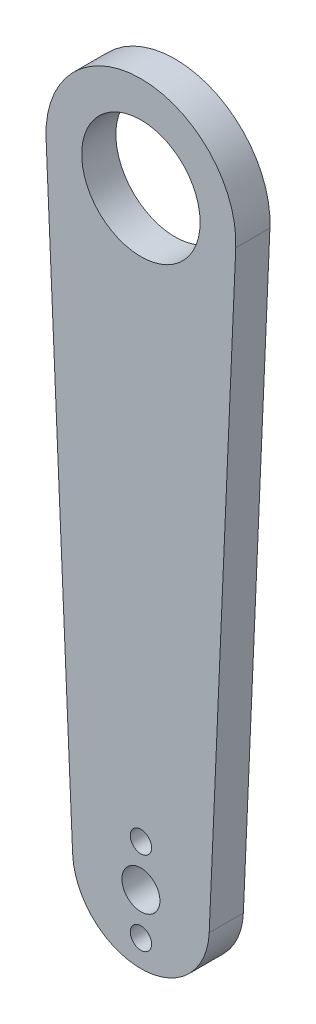
ISO-10303-21;
HEADER;
FILE_DESCRIPTION(('STEP AP214'),'2;1');
FILE_NAME('part.step','',(''),(''),'','','');
FILE_SCHEMA(('AUTOMOTIVE_DESIGN { 1 0 10303 214 1 1 1 1 }'));
ENDSEC;
DATA;
#1=APPLICATION_CONTEXT('core data for automotive mechanical design processes');
#2=APPLICATION_PROTOCOL_DEFINITION('international standard','automotive_design',2000,#1);
#3=PRODUCT_CONTEXT('',#1,'mechanical');
#4=PRODUCT('Part','Part','',(#3));
#5=PRODUCT_RELATED_PRODUCT_CATEGORY('part','',(#4));
#6=PRODUCT_DEFINITION_FORMATION('','',#4);
#7=PRODUCT_DEFINITION_CONTEXT('part definition',#1,'design');
#8=PRODUCT_DEFINITION('design','',#6,#7);
#9=PRODUCT_DEFINITION_SHAPE('','',#8);
#10=(LENGTH_UNIT() NAMED_UNIT(*) SI_UNIT(.MILLI.,.METRE.));
#11=(NAMED_UNIT(*) PLANE_ANGLE_UNIT() SI_UNIT($,.RADIAN.));
#12=(NAMED_UNIT(*) SI_UNIT($,.STERADIAN.) SOLID_ANGLE_UNIT());
#13=UNCERTAINTY_MEASURE_WITH_UNIT(LENGTH_MEASURE(1.E-05),#10,'distance_accuracy_value','');
#14=(GEOMETRIC_REPRESENTATION_CONTEXT(3) GLOBAL_UNCERTAINTY_ASSIGNED_CONTEXT((#13)) GLOBAL_UNIT_ASSIGNED_CONTEXT((#10,
#11,#12)) REPRESENTATION_CONTEXT('',''));
#15=CARTESIAN_POINT('',(0.,0.,0.));
#16=DIRECTION('',(0.,0.,1.));
#17=DIRECTION('',(1.,0.,0.));
#18=AXIS2_PLACEMENT_3D('',#15,#16,#17);
#19=CARTESIAN_POINT('',(0.,0.,4.5));
#20=DIRECTION('',(0.,0.,1.));
#21=DIRECTION('',(1.,0.,0.));
#22=AXIS2_PLACEMENT_3D('',#19,#20,#21);
#23=PLANE('',#22);
#24=CARTESIAN_POINT('',(0.,-5.5,4.5));
#25=DIRECTION('',(0.,0.,1.));
#26=DIRECTION('',(1.,0.,0.));
#27=AXIS2_PLACEMENT_3D('',#24,#25,#26);
#28=CIRCLE('',#27,1.4);
#29=CARTESIAN_POINT('',(1.4,-5.5,4.5));
#30=VERTEX_POINT('',#29);
#31=EDGE_CURVE('E147',#30,#30,#28,.T.);
#32=ORIENTED_EDGE('',*,*,#31,.F.);
#33=EDGE_LOOP('',(#32));
#34=FACE_BOUND('',#33,.T.);
#35=CARTESIAN_POINT('',(0.,0.,4.5));
#36=DIRECTION('',(0.,0.,1.));
#37=DIRECTION('',(1.,0.,0.));
#38=AXIS2_PLACEMENT_3D('',#35,#36,#37);
#39=CIRCLE('',#38,2.5);
#40=CARTESIAN_POINT('',(2.5,0.,4.5));
#41=VERTEX_POINT('',#40);
#42=EDGE_CURVE('E117',#41,#41,#39,.T.);
#43=ORIENTED_EDGE('',*,*,#42,.F.);
#44=EDGE_LOOP('',(#43));
#45=FACE_BOUND('',#44,.T.);
#46=CARTESIAN_POINT('',(0.,0.,4.5));
#47=DIRECTION('',(0.,0.,1.));
#48=DIRECTION('',(1.,0.,0.));
#49=AXIS2_PLACEMENT_3D('',#46,#47,#48);
#50=CIRCLE('',#49,9.);
#51=CARTESIAN_POINT('',(-8.99138259321112,-0.39375,4.5));
#52=VERTEX_POINT('',#51);
#53=CARTESIAN_POINT('',(8.99138259321112,-0.39375,4.5));
#54=VERTEX_POINT('',#53);
#55=EDGE_CURVE('E97',#52,#54,#50,.T.);
#56=ORIENTED_EDGE('',*,*,#55,.T.);
#57=DIRECTION('',(0.04375,0.999042510356792,0.));
#58=VECTOR('',#57,1.);
#59=CARTESIAN_POINT('',(12.4880313794599,79.453125,4.5));
#60=LINE('',#59,#58);
#61=CARTESIAN_POINT('',(12.4880313794599,79.453125,4.5));
#62=VERTEX_POINT('',#61);
#63=EDGE_CURVE('E92',#54,#62,#60,.T.);
#64=ORIENTED_EDGE('',*,*,#63,.T.);
#65=CARTESIAN_POINT('',(0.,80.,4.5));
#66=DIRECTION('',(0.,0.,1.));
#67=DIRECTION('',(1.,0.,0.));
#68=AXIS2_PLACEMENT_3D('',#65,#66,#67);
#69=CIRCLE('',#68,12.5);
#70=CARTESIAN_POINT('',(-12.4880313794599,79.453125,4.5));
#71=VERTEX_POINT('',#70);
#72=EDGE_CURVE('E95',#62,#71,#69,.T.);
#73=ORIENTED_EDGE('',*,*,#72,.T.);
#74=DIRECTION('',(0.04375,-0.999042510356792,0.));
#75=VECTOR('',#74,1.);
#76=CARTESIAN_POINT('',(-8.99138259321112,-0.39375,4.5));
#77=LINE('',#76,#75);
#78=EDGE_CURVE('E62',#71,#52,#77,.T.);
#79=ORIENTED_EDGE('',*,*,#78,.T.);
#80=EDGE_LOOP('',(#56,#64,#73,#79));
#81=FACE_BOUND('',#80,.T.);
#82=CARTESIAN_POINT('',(0.,5.5,4.5));
#83=DIRECTION('',(0.,0.,1.));
#84=DIRECTION('',(1.,0.,0.));
#85=AXIS2_PLACEMENT_3D('',#82,#83,#84);
#86=CIRCLE('',#85,1.4);
#87=CARTESIAN_POINT('',(1.4,5.5,4.5));
#88=VERTEX_POINT('',#87);
#89=EDGE_CURVE('E139',#88,#88,#86,.T.);
#90=ORIENTED_EDGE('',*,*,#89,.F.);
#91=EDGE_LOOP('',(#90));
#92=FACE_BOUND('',#91,.T.);
#93=CARTESIAN_POINT('',(0.,80.,4.5));
#94=DIRECTION('',(0.,0.,1.));
#95=DIRECTION('',(1.,0.,0.));
#96=AXIS2_PLACEMENT_3D('',#93,#94,#95);
#97=CIRCLE('',#96,7.8);
#98=CARTESIAN_POINT('',(7.8,80.,4.5));
#99=VERTEX_POINT('',#98);
#100=EDGE_CURVE('E155',#99,#99,#97,.T.);
#101=ORIENTED_EDGE('',*,*,#100,.F.);
#102=EDGE_LOOP('',(#101));
#103=FACE_BOUND('',#102,.T.);
#104=ADVANCED_FACE('F44',(#34,#45,#81,#92,#103),#23,.T.);
#105=CARTESIAN_POINT('',(0.,0.,0.));
#106=DIRECTION('',(0.,0.,1.));
#107=DIRECTION('',(1.,0.,0.));
#108=AXIS2_PLACEMENT_3D('',#105,#106,#107);
#109=PLANE('',#108);
#110=CARTESIAN_POINT('',(0.,0.,0.));
#111=DIRECTION('',(0.,0.,1.));
#112=DIRECTION('',(1.,0.,0.));
#113=AXIS2_PLACEMENT_3D('',#110,#111,#112);
#114=CIRCLE('',#113,9.);
#115=CARTESIAN_POINT('',(-8.99138259321112,-0.39375,0.));
#116=VERTEX_POINT('',#115);
#117=CARTESIAN_POINT('',(8.99138259321112,-0.39375,0.));
#118=VERTEX_POINT('',#117);
#119=EDGE_CURVE('E113',#116,#118,#114,.T.);
#120=ORIENTED_EDGE('',*,*,#119,.F.);
#121=DIRECTION('',(0.04375,-0.999042510356792,0.));
#122=VECTOR('',#121,1.);
#123=CARTESIAN_POINT('',(-8.99138259321112,-0.39375,0.));
#124=LINE('',#123,#122);
#125=CARTESIAN_POINT('',(-12.4880313794599,79.453125,0.));
#126=VERTEX_POINT('',#125);
#127=EDGE_CURVE('E85',#126,#116,#124,.T.);
#128=ORIENTED_EDGE('',*,*,#127,.F.);
#129=CARTESIAN_POINT('',(0.,80.,0.));
#130=DIRECTION('',(0.,0.,1.));
#131=DIRECTION('',(1.,0.,0.));
#132=AXIS2_PLACEMENT_3D('',#129,#130,#131);
#133=CIRCLE('',#132,12.5);
#134=CARTESIAN_POINT('',(12.4880313794599,79.453125,0.));
#135=VERTEX_POINT('',#134);
#136=EDGE_CURVE('E79',#135,#126,#133,.T.);
#137=ORIENTED_EDGE('',*,*,#136,.F.);
#138=DIRECTION('',(0.04375,0.999042510356792,0.));
#139=VECTOR('',#138,1.);
#140=CARTESIAN_POINT('',(12.4880313794599,79.453125,0.));
#141=LINE('',#140,#139);
#142=EDGE_CURVE('E102',#118,#135,#141,.T.);
#143=ORIENTED_EDGE('',*,*,#142,.F.);
#144=EDGE_LOOP('',(#120,#128,#137,#143));
#145=FACE_BOUND('',#144,.T.);
#146=CARTESIAN_POINT('',(0.,0.,0.));
#147=DIRECTION('',(0.,0.,1.));
#148=DIRECTION('',(1.,0.,0.));
#149=AXIS2_PLACEMENT_3D('',#146,#147,#148);
#150=CIRCLE('',#149,2.5);
#151=CARTESIAN_POINT('',(2.5,0.,0.));
#152=VERTEX_POINT('',#151);
#153=EDGE_CURVE('E135',#152,#152,#150,.T.);
#154=ORIENTED_EDGE('',*,*,#153,.T.);
#155=EDGE_LOOP('',(#154));
#156=FACE_BOUND('',#155,.T.);
#157=CARTESIAN_POINT('',(0.,5.5,0.));
#158=DIRECTION('',(0.,0.,1.));
#159=DIRECTION('',(1.,0.,0.));
#160=AXIS2_PLACEMENT_3D('',#157,#158,#159);
#161=CIRCLE('',#160,1.4);
#162=CARTESIAN_POINT('',(1.4,5.5,0.));
#163=VERTEX_POINT('',#162);
#164=EDGE_CURVE('E143',#163,#163,#161,.T.);
#165=ORIENTED_EDGE('',*,*,#164,.T.);
#166=EDGE_LOOP('',(#165));
#167=FACE_BOUND('',#166,.T.);
#168=CARTESIAN_POINT('',(0.,-5.5,0.));
#169=DIRECTION('',(0.,0.,1.));
#170=DIRECTION('',(1.,0.,0.));
#171=AXIS2_PLACEMENT_3D('',#168,#169,#170);
#172=CIRCLE('',#171,1.4);
#173=CARTESIAN_POINT('',(1.4,-5.5,0.));
#174=VERTEX_POINT('',#173);
#175=EDGE_CURVE('E151',#174,#174,#172,.T.);
#176=ORIENTED_EDGE('',*,*,#175,.T.);
#177=EDGE_LOOP('',(#176));
#178=FACE_BOUND('',#177,.T.);
#179=CARTESIAN_POINT('',(0.,80.,0.));
#180=DIRECTION('',(0.,0.,1.));
#181=DIRECTION('',(1.,0.,0.));
#182=AXIS2_PLACEMENT_3D('',#179,#180,#181);
#183=CIRCLE('',#182,7.8);
#184=CARTESIAN_POINT('',(7.8,80.,0.));
#185=VERTEX_POINT('',#184);
#186=EDGE_CURVE('E159',#185,#185,#183,.T.);
#187=ORIENTED_EDGE('',*,*,#186,.T.);
#188=EDGE_LOOP('',(#187));
#189=FACE_BOUND('',#188,.T.);
#190=ADVANCED_FACE('F130',(#145,#156,#167,#178,#189),#109,.F.);
#191=CARTESIAN_POINT('',(0.,0.,4.5));
#192=DIRECTION('',(0.,0.,-1.));
#193=DIRECTION('',(-1.,0.,0.));
#194=AXIS2_PLACEMENT_3D('',#191,#192,#193);
#195=CYLINDRICAL_SURFACE('',#194,9.);
#196=ORIENTED_EDGE('',*,*,#119,.T.);
#197=DIRECTION('',(0.,0.,-1.));
#198=VECTOR('',#197,1.);
#199=CARTESIAN_POINT('',(8.99138259321112,-0.39375,4.5));
#200=LINE('',#199,#198);
#201=EDGE_CURVE('E11',#54,#118,#200,.T.);
#202=ORIENTED_EDGE('',*,*,#201,.F.);
#203=ORIENTED_EDGE('',*,*,#55,.F.);
#204=DIRECTION('',(0.,0.,-1.));
#205=VECTOR('',#204,1.);
#206=CARTESIAN_POINT('',(-8.99138259321112,-0.39375,4.5));
#207=LINE('',#206,#205);
#208=EDGE_CURVE('E109',#52,#116,#207,.T.);
#209=ORIENTED_EDGE('',*,*,#208,.T.);
#210=EDGE_LOOP('',(#196,#202,#203,#209));
#211=FACE_BOUND('',#210,.T.);
#212=ADVANCED_FACE('F46',(#211),#195,.T.);
#213=CARTESIAN_POINT('',(12.4880313794599,79.453125,4.5));
#214=DIRECTION('',(-0.999042510356791,0.04375,0.));
#215=DIRECTION('',(-0.04375,-0.999042510356792,0.));
#216=AXIS2_PLACEMENT_3D('',#213,#214,#215);
#217=PLANE('',#216);
#218=ORIENTED_EDGE('',*,*,#142,.T.);
#219=DIRECTION('',(0.,0.,-1.));
#220=VECTOR('',#219,1.);
#221=CARTESIAN_POINT('',(12.4880313794599,79.453125,4.5));
#222=LINE('',#221,#220);
#223=EDGE_CURVE('E54',#62,#135,#222,.T.);
#224=ORIENTED_EDGE('',*,*,#223,.F.);
#225=ORIENTED_EDGE('',*,*,#63,.F.);
#226=ORIENTED_EDGE('',*,*,#201,.T.);
#227=EDGE_LOOP('',(#218,#224,#225,#226));
#228=FACE_BOUND('',#227,.T.);
#229=ADVANCED_FACE('F101',(#228),#217,.F.);
#230=CARTESIAN_POINT('',(0.,80.,4.5));
#231=DIRECTION('',(0.,0.,-1.));
#232=DIRECTION('',(-1.,0.,0.));
#233=AXIS2_PLACEMENT_3D('',#230,#231,#232);
#234=CYLINDRICAL_SURFACE('',#233,12.5);
#235=ORIENTED_EDGE('',*,*,#136,.T.);
#236=DIRECTION('',(0.,0.,-1.));
#237=VECTOR('',#236,1.);
#238=CARTESIAN_POINT('',(-12.4880313794599,79.453125,4.5));
#239=LINE('',#238,#237);
#240=EDGE_CURVE('E104',#71,#126,#239,.T.);
#241=ORIENTED_EDGE('',*,*,#240,.F.);
#242=ORIENTED_EDGE('',*,*,#72,.F.);
#243=ORIENTED_EDGE('',*,*,#223,.T.);
#244=EDGE_LOOP('',(#235,#241,#242,#243));
#245=FACE_BOUND('',#244,.T.);
#246=ADVANCED_FACE('F105',(#245),#234,.T.);
#247=CARTESIAN_POINT('',(-8.99138259321112,-0.39375,4.5));
#248=DIRECTION('',(0.999042510356791,0.04375,0.));
#249=DIRECTION('',(-0.04375,0.999042510356792,0.));
#250=AXIS2_PLACEMENT_3D('',#247,#248,#249);
#251=PLANE('',#250);
#252=ORIENTED_EDGE('',*,*,#127,.T.);
#253=ORIENTED_EDGE('',*,*,#208,.F.);
#254=ORIENTED_EDGE('',*,*,#78,.F.);
#255=ORIENTED_EDGE('',*,*,#240,.T.);
#256=EDGE_LOOP('',(#252,#253,#254,#255));
#257=FACE_BOUND('',#256,.T.);
#258=ADVANCED_FACE('F127',(#257),#251,.F.);
#259=CARTESIAN_POINT('',(0.,0.,4.5));
#260=DIRECTION('',(0.,0.,-1.));
#261=DIRECTION('',(-1.,0.,0.));
#262=AXIS2_PLACEMENT_3D('',#259,#260,#261);
#263=CYLINDRICAL_SURFACE('',#262,2.5);
#264=ORIENTED_EDGE('',*,*,#42,.T.);
#265=EDGE_LOOP('',(#264));
#266=FACE_BOUND('',#265,.T.);
#267=ORIENTED_EDGE('',*,*,#153,.F.);
#268=EDGE_LOOP('',(#267));
#269=FACE_BOUND('',#268,.T.);
#270=ADVANCED_FACE('F180',(#266,#269),#263,.F.);
#271=CARTESIAN_POINT('',(0.,5.5,4.5));
#272=DIRECTION('',(0.,0.,-1.));
#273=DIRECTION('',(-1.,0.,0.));
#274=AXIS2_PLACEMENT_3D('',#271,#272,#273);
#275=CYLINDRICAL_SURFACE('',#274,1.4);
#276=ORIENTED_EDGE('',*,*,#89,.T.);
#277=EDGE_LOOP('',(#276));
#278=FACE_BOUND('',#277,.T.);
#279=ORIENTED_EDGE('',*,*,#164,.F.);
#280=EDGE_LOOP('',(#279));
#281=FACE_BOUND('',#280,.T.);
#282=ADVANCED_FACE('F225',(#278,#281),#275,.F.);
#283=CARTESIAN_POINT('',(0.,-5.5,4.5));
#284=DIRECTION('',(0.,0.,-1.));
#285=DIRECTION('',(-1.,0.,0.));
#286=AXIS2_PLACEMENT_3D('',#283,#284,#285);
#287=CYLINDRICAL_SURFACE('',#286,1.4);
#288=ORIENTED_EDGE('',*,*,#31,.T.);
#289=EDGE_LOOP('',(#288));
#290=FACE_BOUND('',#289,.T.);
#291=ORIENTED_EDGE('',*,*,#175,.F.);
#292=EDGE_LOOP('',(#291));
#293=FACE_BOUND('',#292,.T.);
#294=ADVANCED_FACE('F233',(#290,#293),#287,.F.);
#295=CARTESIAN_POINT('',(0.,80.,4.5));
#296=DIRECTION('',(0.,0.,-1.));
#297=DIRECTION('',(-1.,0.,0.));
#298=AXIS2_PLACEMENT_3D('',#295,#296,#297);
#299=CYLINDRICAL_SURFACE('',#298,7.8);
#300=ORIENTED_EDGE('',*,*,#100,.T.);
#301=EDGE_LOOP('',(#300));
#302=FACE_BOUND('',#301,.T.);
#303=ORIENTED_EDGE('',*,*,#186,.F.);
#304=EDGE_LOOP('',(#303));
#305=FACE_BOUND('',#304,.T.);
#306=ADVANCED_FACE('F167',(#302,#305),#299,.F.);
#307=CLOSED_SHELL('',(#104,#190,#212,#229,#246,#258,#270,#282,#294,#306));
#308=MANIFOLD_SOLID_BREP('B2',#307);
#309=ADVANCED_BREP_SHAPE_REPRESENTATION('',(#18,#308),#14);
#310=SHAPE_DEFINITION_REPRESENTATION(#9,#309);
ENDSEC;
END-ISO-10303-21;
